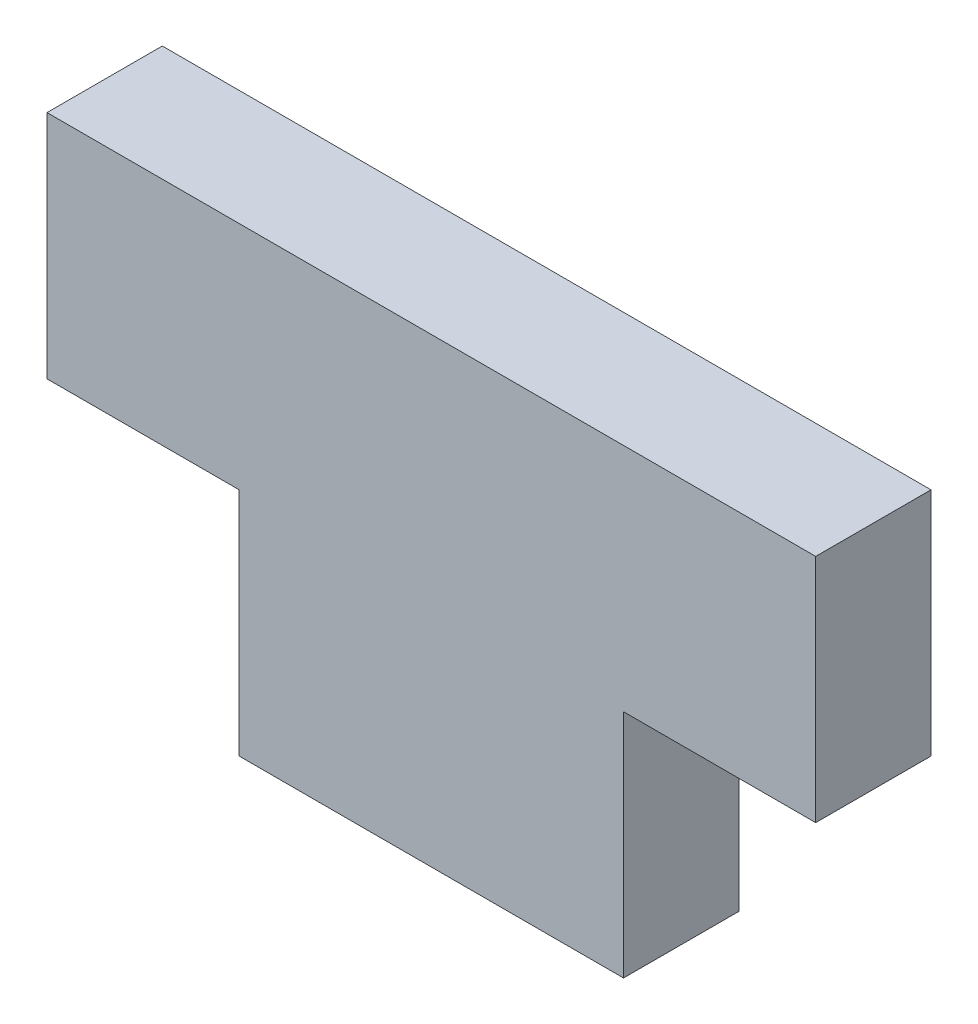
ISO-10303-21;
HEADER;
FILE_DESCRIPTION(('STEP AP214'),'2;1');
FILE_NAME('part.step','',(''),(''),'','','');
FILE_SCHEMA(('AUTOMOTIVE_DESIGN { 1 0 10303 214 1 1 1 1 }'));
ENDSEC;
DATA;
#1=APPLICATION_CONTEXT('core data for automotive mechanical design processes');
#2=APPLICATION_PROTOCOL_DEFINITION('international standard','automotive_design',2000,#1);
#3=PRODUCT_CONTEXT('',#1,'mechanical');
#4=PRODUCT('Part','Part','',(#3));
#5=PRODUCT_RELATED_PRODUCT_CATEGORY('part','',(#4));
#6=PRODUCT_DEFINITION_FORMATION('','',#4);
#7=PRODUCT_DEFINITION_CONTEXT('part definition',#1,'design');
#8=PRODUCT_DEFINITION('design','',#6,#7);
#9=PRODUCT_DEFINITION_SHAPE('','',#8);
#10=(LENGTH_UNIT() NAMED_UNIT(*) SI_UNIT(.MILLI.,.METRE.));
#11=(NAMED_UNIT(*) PLANE_ANGLE_UNIT() SI_UNIT($,.RADIAN.));
#12=(NAMED_UNIT(*) SI_UNIT($,.STERADIAN.) SOLID_ANGLE_UNIT());
#13=UNCERTAINTY_MEASURE_WITH_UNIT(LENGTH_MEASURE(1.E-05),#10,'distance_accuracy_value','');
#14=(GEOMETRIC_REPRESENTATION_CONTEXT(3) GLOBAL_UNCERTAINTY_ASSIGNED_CONTEXT((#13)) GLOBAL_UNIT_ASSIGNED_CONTEXT((#10,
#11,#12)) REPRESENTATION_CONTEXT('',''));
#15=CARTESIAN_POINT('',(0.,0.,0.));
#16=DIRECTION('',(0.,0.,1.));
#17=DIRECTION('',(1.,0.,0.));
#18=AXIS2_PLACEMENT_3D('',#15,#16,#17);
#19=CARTESIAN_POINT('',(50.,-30.,7.5));
#20=DIRECTION('',(0.,1.,0.));
#21=DIRECTION('',(0.,0.,1.));
#22=AXIS2_PLACEMENT_3D('',#19,#20,#21);
#23=PLANE('',#22);
#24=DIRECTION('',(-1.,0.,0.));
#25=VECTOR('',#24,1.);
#26=CARTESIAN_POINT('',(50.,-30.,-7.5));
#27=LINE('',#26,#25);
#28=CARTESIAN_POINT('',(25.,-30.,-7.5));
#29=VERTEX_POINT('',#28);
#30=CARTESIAN_POINT('',(-25.,-30.,-7.5));
#31=VERTEX_POINT('',#30);
#32=EDGE_CURVE('E165',#29,#31,#27,.T.);
#33=ORIENTED_EDGE('',*,*,#32,.F.);
#34=DIRECTION('',(0.,0.,1.));
#35=VECTOR('',#34,1.);
#36=CARTESIAN_POINT('',(25.,-30.,-12.5));
#37=LINE('',#36,#35);
#38=CARTESIAN_POINT('',(25.,-30.,7.5));
#39=VERTEX_POINT('',#38);
#40=EDGE_CURVE('E204',#29,#39,#37,.T.);
#41=ORIENTED_EDGE('',*,*,#40,.T.);
#42=DIRECTION('',(-1.,0.,0.));
#43=VECTOR('',#42,1.);
#44=CARTESIAN_POINT('',(50.,-30.,7.5));
#45=LINE('',#44,#43);
#46=CARTESIAN_POINT('',(-25.,-30.,7.5));
#47=VERTEX_POINT('',#46);
#48=EDGE_CURVE('E139',#39,#47,#45,.T.);
#49=ORIENTED_EDGE('',*,*,#48,.T.);
#50=DIRECTION('',(0.,0.,1.));
#51=VECTOR('',#50,1.);
#52=CARTESIAN_POINT('',(-25.,-30.,-12.5));
#53=LINE('',#52,#51);
#54=EDGE_CURVE('E190',#31,#47,#53,.T.);
#55=ORIENTED_EDGE('',*,*,#54,.F.);
#56=EDGE_LOOP('',(#33,#41,#49,#55));
#57=FACE_BOUND('',#56,.T.);
#58=ADVANCED_FACE('F56',(#57),#23,.F.);
#59=CARTESIAN_POINT('',(50.,-30.,-7.5));
#60=DIRECTION('',(0.,0.,1.));
#61=DIRECTION('',(1.,0.,0.));
#62=AXIS2_PLACEMENT_3D('',#59,#60,#61);
#63=PLANE('',#62);
#64=DIRECTION('',(-1.,0.,0.));
#65=VECTOR('',#64,1.);
#66=CARTESIAN_POINT('',(50.,0.,-7.5));
#67=LINE('',#66,#65);
#68=CARTESIAN_POINT('',(50.,0.,-7.5));
#69=VERTEX_POINT('',#68);
#70=CARTESIAN_POINT('',(25.,0.,-7.5));
#71=VERTEX_POINT('',#70);
#72=EDGE_CURVE('E69',#69,#71,#67,.T.);
#73=ORIENTED_EDGE('',*,*,#72,.T.);
#74=DIRECTION('',(0.,-1.,0.));
#75=VECTOR('',#74,1.);
#76=CARTESIAN_POINT('',(25.,-30.,-7.5));
#77=LINE('',#76,#75);
#78=EDGE_CURVE('E200',#71,#29,#77,.T.);
#79=ORIENTED_EDGE('',*,*,#78,.T.);
#80=ORIENTED_EDGE('',*,*,#32,.T.);
#81=DIRECTION('',(0.,1.,0.));
#82=VECTOR('',#81,1.);
#83=CARTESIAN_POINT('',(-25.,-30.,-7.5));
#84=LINE('',#83,#82);
#85=CARTESIAN_POINT('',(-25.,0.,-7.5));
#86=VERTEX_POINT('',#85);
#87=EDGE_CURVE('E180',#31,#86,#84,.T.);
#88=ORIENTED_EDGE('',*,*,#87,.T.);
#89=DIRECTION('',(-1.,0.,0.));
#90=VECTOR('',#89,1.);
#91=CARTESIAN_POINT('',(50.,0.,-7.5));
#92=LINE('',#91,#90);
#93=CARTESIAN_POINT('',(-50.,0.,-7.5));
#94=VERTEX_POINT('',#93);
#95=EDGE_CURVE('E184',#86,#94,#92,.T.);
#96=ORIENTED_EDGE('',*,*,#95,.T.);
#97=DIRECTION('',(0.,1.,0.));
#98=VECTOR('',#97,1.);
#99=CARTESIAN_POINT('',(-50.,-30.,-7.5));
#100=LINE('',#99,#98);
#101=CARTESIAN_POINT('',(-50.,30.,-7.5));
#102=VERTEX_POINT('',#101);
#103=EDGE_CURVE('E150',#94,#102,#100,.T.);
#104=ORIENTED_EDGE('',*,*,#103,.T.);
#105=DIRECTION('',(-1.,0.,0.));
#106=VECTOR('',#105,1.);
#107=CARTESIAN_POINT('',(50.,30.,-7.5));
#108=LINE('',#107,#106);
#109=CARTESIAN_POINT('',(50.,30.,-7.5));
#110=VERTEX_POINT('',#109);
#111=EDGE_CURVE('E161',#110,#102,#108,.T.);
#112=ORIENTED_EDGE('',*,*,#111,.F.);
#113=DIRECTION('',(0.,1.,0.));
#114=VECTOR('',#113,1.);
#115=CARTESIAN_POINT('',(50.,-30.,-7.5));
#116=LINE('',#115,#114);
#117=EDGE_CURVE('E145',#69,#110,#116,.T.);
#118=ORIENTED_EDGE('',*,*,#117,.F.);
#119=EDGE_LOOP('',(#73,#79,#80,#88,#96,#104,#112,#118));
#120=FACE_BOUND('',#119,.T.);
#121=ADVANCED_FACE('F222',(#120),#63,.F.);
#122=CARTESIAN_POINT('',(50.,30.,7.5));
#123=DIRECTION('',(0.,-1.,0.));
#124=DIRECTION('',(0.,0.,-1.));
#125=AXIS2_PLACEMENT_3D('',#122,#123,#124);
#126=PLANE('',#125);
#127=DIRECTION('',(0.,0.,1.));
#128=VECTOR('',#127,1.);
#129=CARTESIAN_POINT('',(-50.,30.,7.5));
#130=LINE('',#129,#128);
#131=CARTESIAN_POINT('',(-50.,30.,7.5));
#132=VERTEX_POINT('',#131);
#133=EDGE_CURVE('E176',#102,#132,#130,.T.);
#134=ORIENTED_EDGE('',*,*,#133,.T.);
#135=DIRECTION('',(-1.,0.,0.));
#136=VECTOR('',#135,1.);
#137=CARTESIAN_POINT('',(50.,30.,7.5));
#138=LINE('',#137,#136);
#139=CARTESIAN_POINT('',(50.,30.,7.5));
#140=VERTEX_POINT('',#139);
#141=EDGE_CURVE('E143',#140,#132,#138,.T.);
#142=ORIENTED_EDGE('',*,*,#141,.F.);
#143=DIRECTION('',(0.,0.,1.));
#144=VECTOR('',#143,1.);
#145=CARTESIAN_POINT('',(50.,30.,7.5));
#146=LINE('',#145,#144);
#147=EDGE_CURVE('E136',#110,#140,#146,.T.);
#148=ORIENTED_EDGE('',*,*,#147,.F.);
#149=ORIENTED_EDGE('',*,*,#111,.T.);
#150=EDGE_LOOP('',(#134,#142,#148,#149));
#151=FACE_BOUND('',#150,.T.);
#152=ADVANCED_FACE('F224',(#151),#126,.F.);
#153=CARTESIAN_POINT('',(50.,-30.,7.5));
#154=DIRECTION('',(0.,0.,-1.));
#155=DIRECTION('',(-1.,0.,0.));
#156=AXIS2_PLACEMENT_3D('',#153,#154,#155);
#157=PLANE('',#156);
#158=ORIENTED_EDGE('',*,*,#48,.F.);
#159=DIRECTION('',(0.,-1.,0.));
#160=VECTOR('',#159,1.);
#161=CARTESIAN_POINT('',(25.,0.,7.5));
#162=LINE('',#161,#160);
#163=CARTESIAN_POINT('',(25.,0.,7.5));
#164=VERTEX_POINT('',#163);
#165=EDGE_CURVE('E131',#164,#39,#162,.T.);
#166=ORIENTED_EDGE('',*,*,#165,.F.);
#167=DIRECTION('',(-1.,0.,0.));
#168=VECTOR('',#167,1.);
#169=CARTESIAN_POINT('',(50.,0.,7.5));
#170=LINE('',#169,#168);
#171=CARTESIAN_POINT('',(50.,0.,7.5));
#172=VERTEX_POINT('',#171);
#173=EDGE_CURVE('E120',#172,#164,#170,.T.);
#174=ORIENTED_EDGE('',*,*,#173,.F.);
#175=DIRECTION('',(0.,-1.,0.));
#176=VECTOR('',#175,1.);
#177=CARTESIAN_POINT('',(50.,-30.,7.5));
#178=LINE('',#177,#176);
#179=EDGE_CURVE('E130',#140,#172,#178,.T.);
#180=ORIENTED_EDGE('',*,*,#179,.F.);
#181=ORIENTED_EDGE('',*,*,#141,.T.);
#182=DIRECTION('',(0.,-1.,0.));
#183=VECTOR('',#182,1.);
#184=CARTESIAN_POINT('',(-50.,-30.,7.5));
#185=LINE('',#184,#183);
#186=CARTESIAN_POINT('',(-50.,0.,7.5));
#187=VERTEX_POINT('',#186);
#188=EDGE_CURVE('E172',#132,#187,#185,.T.);
#189=ORIENTED_EDGE('',*,*,#188,.T.);
#190=DIRECTION('',(-1.,0.,0.));
#191=VECTOR('',#190,1.);
#192=CARTESIAN_POINT('',(-50.,0.,7.5));
#193=LINE('',#192,#191);
#194=CARTESIAN_POINT('',(-25.,0.,7.5));
#195=VERTEX_POINT('',#194);
#196=EDGE_CURVE('E77',#195,#187,#193,.T.);
#197=ORIENTED_EDGE('',*,*,#196,.F.);
#198=DIRECTION('',(0.,1.,0.));
#199=VECTOR('',#198,1.);
#200=CARTESIAN_POINT('',(-25.,0.,7.5));
#201=LINE('',#200,#199);
#202=EDGE_CURVE('E195',#47,#195,#201,.T.);
#203=ORIENTED_EDGE('',*,*,#202,.F.);
#204=EDGE_LOOP('',(#158,#166,#174,#180,#181,#189,#197,#203));
#205=FACE_BOUND('',#204,.T.);
#206=ADVANCED_FACE('F128',(#205),#157,.F.);
#207=CARTESIAN_POINT('',(50.,-30.,-7.5));
#208=DIRECTION('',(1.,0.,0.));
#209=DIRECTION('',(0.,0.,-1.));
#210=AXIS2_PLACEMENT_3D('',#207,#208,#209);
#211=PLANE('',#210);
#212=DIRECTION('',(0.,0.,1.));
#213=VECTOR('',#212,1.);
#214=CARTESIAN_POINT('',(50.,0.,-7.5));
#215=LINE('',#214,#213);
#216=EDGE_CURVE('E13',#69,#172,#215,.T.);
#217=ORIENTED_EDGE('',*,*,#216,.F.);
#218=ORIENTED_EDGE('',*,*,#117,.T.);
#219=ORIENTED_EDGE('',*,*,#147,.T.);
#220=ORIENTED_EDGE('',*,*,#179,.T.);
#221=EDGE_LOOP('',(#217,#218,#219,#220));
#222=FACE_BOUND('',#221,.T.);
#223=ADVANCED_FACE('F134',(#222),#211,.T.);
#224=CARTESIAN_POINT('',(-50.,-30.,-7.5));
#225=DIRECTION('',(1.,0.,0.));
#226=DIRECTION('',(0.,0.,-1.));
#227=AXIS2_PLACEMENT_3D('',#224,#225,#226);
#228=PLANE('',#227);
#229=ORIENTED_EDGE('',*,*,#103,.F.);
#230=DIRECTION('',(0.,0.,1.));
#231=VECTOR('',#230,1.);
#232=CARTESIAN_POINT('',(-50.,0.,-7.5));
#233=LINE('',#232,#231);
#234=EDGE_CURVE('E63',#94,#187,#233,.T.);
#235=ORIENTED_EDGE('',*,*,#234,.T.);
#236=ORIENTED_EDGE('',*,*,#188,.F.);
#237=ORIENTED_EDGE('',*,*,#133,.F.);
#238=EDGE_LOOP('',(#229,#235,#236,#237));
#239=FACE_BOUND('',#238,.T.);
#240=ADVANCED_FACE('F170',(#239),#228,.F.);
#241=CARTESIAN_POINT('',(-25.,0.,-12.5));
#242=DIRECTION('',(1.,0.,0.));
#243=DIRECTION('',(0.,1.,0.));
#244=AXIS2_PLACEMENT_3D('',#241,#242,#243);
#245=PLANE('',#244);
#246=ORIENTED_EDGE('',*,*,#54,.T.);
#247=ORIENTED_EDGE('',*,*,#202,.T.);
#248=DIRECTION('',(0.,0.,1.));
#249=VECTOR('',#248,1.);
#250=CARTESIAN_POINT('',(-25.,0.,-12.5));
#251=LINE('',#250,#249);
#252=EDGE_CURVE('E187',#86,#195,#251,.T.);
#253=ORIENTED_EDGE('',*,*,#252,.F.);
#254=ORIENTED_EDGE('',*,*,#87,.F.);
#255=EDGE_LOOP('',(#246,#247,#253,#254));
#256=FACE_BOUND('',#255,.T.);
#257=ADVANCED_FACE('F220',(#256),#245,.F.);
#258=CARTESIAN_POINT('',(-50.,0.,-12.5));
#259=DIRECTION('',(0.,1.,0.));
#260=DIRECTION('',(0.,0.,1.));
#261=AXIS2_PLACEMENT_3D('',#258,#259,#260);
#262=PLANE('',#261);
#263=ORIENTED_EDGE('',*,*,#252,.T.);
#264=ORIENTED_EDGE('',*,*,#196,.T.);
#265=ORIENTED_EDGE('',*,*,#234,.F.);
#266=ORIENTED_EDGE('',*,*,#95,.F.);
#267=EDGE_LOOP('',(#263,#264,#265,#266));
#268=FACE_BOUND('',#267,.T.);
#269=ADVANCED_FACE('F221',(#268),#262,.F.);
#270=CARTESIAN_POINT('',(25.,0.,-12.5));
#271=DIRECTION('',(-1.,0.,0.));
#272=DIRECTION('',(0.,-1.,0.));
#273=AXIS2_PLACEMENT_3D('',#270,#271,#272);
#274=PLANE('',#273);
#275=DIRECTION('',(0.,0.,1.));
#276=VECTOR('',#275,1.);
#277=CARTESIAN_POINT('',(25.,0.,-12.5));
#278=LINE('',#277,#276);
#279=EDGE_CURVE('E205',#71,#164,#278,.T.);
#280=ORIENTED_EDGE('',*,*,#279,.T.);
#281=ORIENTED_EDGE('',*,*,#165,.T.);
#282=ORIENTED_EDGE('',*,*,#40,.F.);
#283=ORIENTED_EDGE('',*,*,#78,.F.);
#284=EDGE_LOOP('',(#280,#281,#282,#283));
#285=FACE_BOUND('',#284,.T.);
#286=ADVANCED_FACE('F214',(#285),#274,.F.);
#287=CARTESIAN_POINT('',(50.,0.,-12.5));
#288=DIRECTION('',(0.,1.,0.));
#289=DIRECTION('',(-1.,0.,0.));
#290=AXIS2_PLACEMENT_3D('',#287,#288,#289);
#291=PLANE('',#290);
#292=ORIENTED_EDGE('',*,*,#216,.T.);
#293=ORIENTED_EDGE('',*,*,#173,.T.);
#294=ORIENTED_EDGE('',*,*,#279,.F.);
#295=ORIENTED_EDGE('',*,*,#72,.F.);
#296=EDGE_LOOP('',(#292,#293,#294,#295));
#297=FACE_BOUND('',#296,.T.);
#298=ADVANCED_FACE('F119',(#297),#291,.F.);
#299=CLOSED_SHELL('',(#58,#121,#152,#206,#223,#240,#257,#269,#286,#298));
#300=MANIFOLD_SOLID_BREP('B2',#299);
#301=ADVANCED_BREP_SHAPE_REPRESENTATION('',(#18,#300),#14);
#302=SHAPE_DEFINITION_REPRESENTATION(#9,#301);
ENDSEC;
END-ISO-10303-21;
